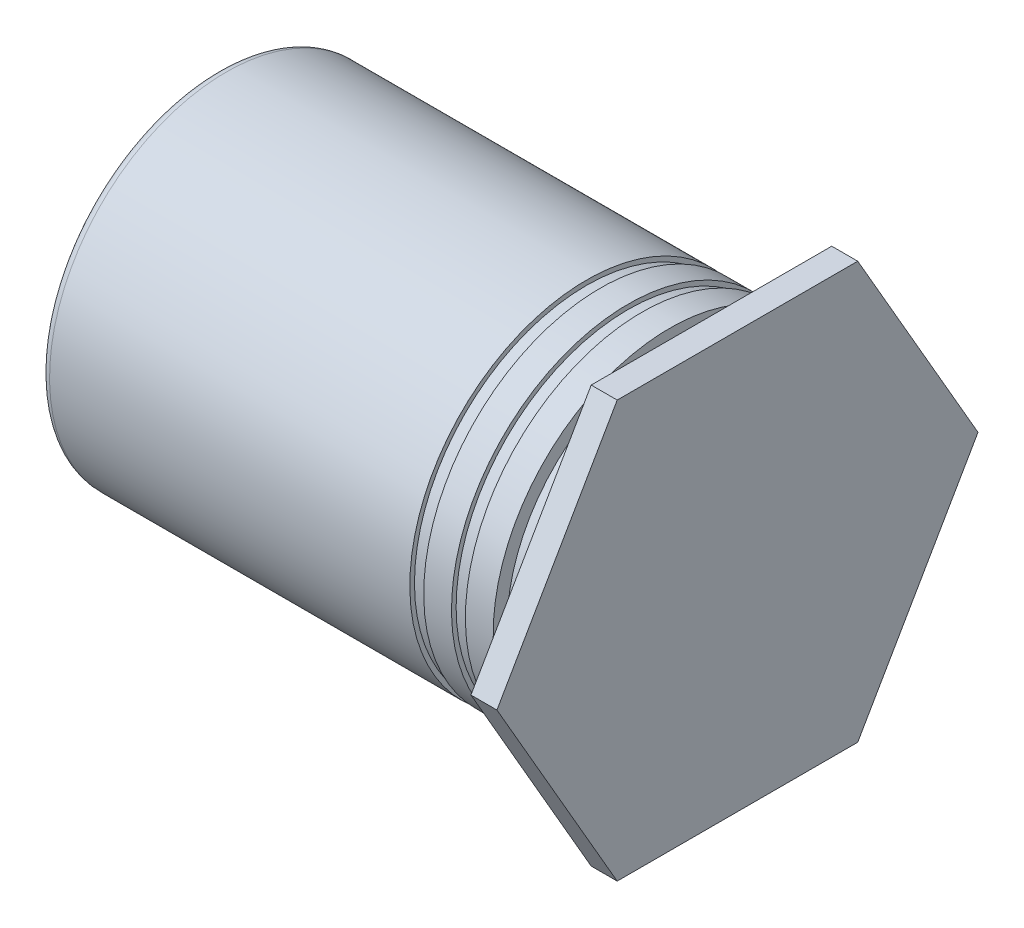
ISO-10303-21;
HEADER;
FILE_DESCRIPTION(('STEP AP214'),'2;1');
FILE_NAME('part.step','',(''),(''),'','','');
FILE_SCHEMA(('AUTOMOTIVE_DESIGN { 1 0 10303 214 1 1 1 1 }'));
ENDSEC;
DATA;
#1=APPLICATION_CONTEXT('core data for automotive mechanical design processes');
#2=APPLICATION_PROTOCOL_DEFINITION('international standard','automotive_design',2000,#1);
#3=PRODUCT_CONTEXT('',#1,'mechanical');
#4=PRODUCT('Part','Part','',(#3));
#5=PRODUCT_RELATED_PRODUCT_CATEGORY('part','',(#4));
#6=PRODUCT_DEFINITION_FORMATION('','',#4);
#7=PRODUCT_DEFINITION_CONTEXT('part definition',#1,'design');
#8=PRODUCT_DEFINITION('design','',#6,#7);
#9=PRODUCT_DEFINITION_SHAPE('','',#8);
#10=(LENGTH_UNIT() NAMED_UNIT(*) SI_UNIT(.MILLI.,.METRE.));
#11=(NAMED_UNIT(*) PLANE_ANGLE_UNIT() SI_UNIT($,.RADIAN.));
#12=(NAMED_UNIT(*) SI_UNIT($,.STERADIAN.) SOLID_ANGLE_UNIT());
#13=UNCERTAINTY_MEASURE_WITH_UNIT(LENGTH_MEASURE(1.E-05),#10,'distance_accuracy_value','');
#14=(GEOMETRIC_REPRESENTATION_CONTEXT(3) GLOBAL_UNCERTAINTY_ASSIGNED_CONTEXT((#13)) GLOBAL_UNIT_ASSIGNED_CONTEXT((#10,
#11,#12)) REPRESENTATION_CONTEXT('',''));
#15=CARTESIAN_POINT('',(0.,0.,0.));
#16=DIRECTION('',(0.,0.,1.));
#17=DIRECTION('',(1.,0.,0.));
#18=AXIS2_PLACEMENT_3D('',#15,#16,#17);
#19=CARTESIAN_POINT('',(0.396240000000001,-1.905,0.));
#20=DIRECTION('',(1.,0.,0.));
#21=DIRECTION('',(0.,1.,0.));
#22=AXIS2_PLACEMENT_3D('',#19,#20,#21);
#23=PLANE('',#22);
#24=DIRECTION('',(0.,0.,-1.));
#25=VECTOR('',#24,1.);
#26=CARTESIAN_POINT('',(0.39624,-3.175,0.));
#27=LINE('',#26,#25);
#28=CARTESIAN_POINT('',(0.39624,-3.175,-1.83308710467706));
#29=VERTEX_POINT('',#28);
#30=CARTESIAN_POINT('',(0.39624,-3.175,1.83308710467706));
#31=VERTEX_POINT('',#30);
#32=EDGE_CURVE('E200',#29,#31,#27,.F.);
#33=ORIENTED_EDGE('',*,*,#32,.F.);
#34=DIRECTION('',(0.,0.866025403784439,-0.5));
#35=VECTOR('',#34,1.);
#36=CARTESIAN_POINT('',(0.39624,-1.5875,-2.74963065701559));
#37=LINE('',#36,#35);
#38=CARTESIAN_POINT('',(0.39624,0.,-3.66617420935412));
#39=VERTEX_POINT('',#38);
#40=EDGE_CURVE('E73',#39,#29,#37,.F.);
#41=ORIENTED_EDGE('',*,*,#40,.F.);
#42=DIRECTION('',(0.,0.866025403784438,0.500000000000001));
#43=VECTOR('',#42,1.);
#44=CARTESIAN_POINT('',(0.39624,1.5875,-2.74963065701559));
#45=LINE('',#44,#43);
#46=CARTESIAN_POINT('',(0.396240000000001,3.175,-1.83308710467706));
#47=VERTEX_POINT('',#46);
#48=EDGE_CURVE('E69',#47,#39,#45,.F.);
#49=ORIENTED_EDGE('',*,*,#48,.F.);
#50=DIRECTION('',(0.,0.,1.));
#51=VECTOR('',#50,1.);
#52=CARTESIAN_POINT('',(0.39624,3.175,0.));
#53=LINE('',#52,#51);
#54=CARTESIAN_POINT('',(0.39624,3.175,1.83308710467706));
#55=VERTEX_POINT('',#54);
#56=EDGE_CURVE('E90',#55,#47,#53,.F.);
#57=ORIENTED_EDGE('',*,*,#56,.F.);
#58=DIRECTION('',(0.,-0.866025403784439,0.5));
#59=VECTOR('',#58,1.);
#60=CARTESIAN_POINT('',(0.39624,1.5875,2.74963065701559));
#61=LINE('',#60,#59);
#62=CARTESIAN_POINT('',(0.39624,0.,3.66617420935412));
#63=VERTEX_POINT('',#62);
#64=EDGE_CURVE('E211',#63,#55,#61,.F.);
#65=ORIENTED_EDGE('',*,*,#64,.F.);
#66=DIRECTION('',(0.,-0.866025403784438,-0.5));
#67=VECTOR('',#66,1.);
#68=CARTESIAN_POINT('',(0.39624,-1.5875,2.74963065701559));
#69=LINE('',#68,#67);
#70=EDGE_CURVE('E204',#31,#63,#69,.F.);
#71=ORIENTED_EDGE('',*,*,#70,.F.);
#72=EDGE_LOOP('',(#33,#41,#49,#57,#65,#71));
#73=FACE_BOUND('',#72,.T.);
#74=ADVANCED_FACE('F17',(#73),#23,.T.);
#75=CARTESIAN_POINT('',(0.19812,1.5875,-2.74963065701559));
#76=DIRECTION('',(0.,0.500000000000001,-0.866025403784438));
#77=DIRECTION('',(0.,0.866025403784438,0.500000000000001));
#78=AXIS2_PLACEMENT_3D('',#75,#76,#77);
#79=PLANE('',#78);
#80=DIRECTION('',(1.,0.,0.));
#81=VECTOR('',#80,1.);
#82=CARTESIAN_POINT('',(0.19812,0.,-3.66617420935412));
#83=LINE('',#82,#81);
#84=CARTESIAN_POINT('',(0.,0.,-3.66617420935412));
#85=VERTEX_POINT('',#84);
#86=EDGE_CURVE('E60',#85,#39,#83,.T.);
#87=ORIENTED_EDGE('',*,*,#86,.F.);
#88=DIRECTION('',(0.,-0.866025403784438,-0.500000000000001));
#89=VECTOR('',#88,1.);
#90=CARTESIAN_POINT('',(0.,3.175,-1.83308710467706));
#91=LINE('',#90,#89);
#92=CARTESIAN_POINT('',(0.,3.175,-1.83308710467706));
#93=VERTEX_POINT('',#92);
#94=EDGE_CURVE('E65',#93,#85,#91,.T.);
#95=ORIENTED_EDGE('',*,*,#94,.F.);
#96=DIRECTION('',(1.,0.,0.));
#97=VECTOR('',#96,1.);
#98=CARTESIAN_POINT('',(0.19812,3.175,-1.83308710467706));
#99=LINE('',#98,#97);
#100=EDGE_CURVE('E187',#47,#93,#99,.F.);
#101=ORIENTED_EDGE('',*,*,#100,.F.);
#102=ORIENTED_EDGE('',*,*,#48,.T.);
#103=EDGE_LOOP('',(#87,#95,#101,#102));
#104=FACE_BOUND('',#103,.T.);
#105=ADVANCED_FACE('F62',(#104),#79,.T.);
#106=CARTESIAN_POINT('',(0.19812,-1.5875,-2.74963065701559));
#107=DIRECTION('',(0.,-0.5,-0.866025403784439));
#108=DIRECTION('',(0.,0.866025403784439,-0.5));
#109=AXIS2_PLACEMENT_3D('',#106,#107,#108);
#110=PLANE('',#109);
#111=DIRECTION('',(1.,0.,0.));
#112=VECTOR('',#111,1.);
#113=CARTESIAN_POINT('',(0.19812,-3.175,-1.83308710467706));
#114=LINE('',#113,#112);
#115=CARTESIAN_POINT('',(0.,-3.175,-1.83308710467706));
#116=VERTEX_POINT('',#115);
#117=EDGE_CURVE('E79',#116,#29,#114,.T.);
#118=ORIENTED_EDGE('',*,*,#117,.F.);
#119=DIRECTION('',(0.,-0.866025403784439,0.5));
#120=VECTOR('',#119,1.);
#121=CARTESIAN_POINT('',(0.,0.,-3.66617420935412));
#122=LINE('',#121,#120);
#123=EDGE_CURVE('E76',#85,#116,#122,.T.);
#124=ORIENTED_EDGE('',*,*,#123,.F.);
#125=ORIENTED_EDGE('',*,*,#86,.T.);
#126=ORIENTED_EDGE('',*,*,#40,.T.);
#127=EDGE_LOOP('',(#118,#124,#125,#126));
#128=FACE_BOUND('',#127,.T.);
#129=ADVANCED_FACE('F77',(#128),#110,.T.);
#130=CARTESIAN_POINT('',(0.19812,-3.175,0.));
#131=DIRECTION('',(0.,-1.,0.));
#132=DIRECTION('',(0.,0.,-1.));
#133=AXIS2_PLACEMENT_3D('',#130,#131,#132);
#134=PLANE('',#133);
#135=DIRECTION('',(1.,0.,0.));
#136=VECTOR('',#135,1.);
#137=CARTESIAN_POINT('',(0.19812,-3.175,1.83308710467706));
#138=LINE('',#137,#136);
#139=CARTESIAN_POINT('',(0.,-3.175,1.83308710467706));
#140=VERTEX_POINT('',#139);
#141=EDGE_CURVE('E197',#140,#31,#138,.T.);
#142=ORIENTED_EDGE('',*,*,#141,.F.);
#143=DIRECTION('',(0.,0.,1.));
#144=VECTOR('',#143,1.);
#145=CARTESIAN_POINT('',(0.,-3.175,0.));
#146=LINE('',#145,#144);
#147=EDGE_CURVE('E83',#116,#140,#146,.T.);
#148=ORIENTED_EDGE('',*,*,#147,.F.);
#149=ORIENTED_EDGE('',*,*,#117,.T.);
#150=ORIENTED_EDGE('',*,*,#32,.T.);
#151=EDGE_LOOP('',(#142,#148,#149,#150));
#152=FACE_BOUND('',#151,.T.);
#153=ADVANCED_FACE('F193',(#152),#134,.T.);
#154=CARTESIAN_POINT('',(0.19812,-1.5875,2.74963065701559));
#155=DIRECTION('',(0.,-0.5,0.866025403784438));
#156=DIRECTION('',(0.,-0.866025403784438,-0.5));
#157=AXIS2_PLACEMENT_3D('',#154,#155,#156);
#158=PLANE('',#157);
#159=DIRECTION('',(1.,0.,0.));
#160=VECTOR('',#159,1.);
#161=CARTESIAN_POINT('',(0.19812,0.,3.66617420935412));
#162=LINE('',#161,#160);
#163=CARTESIAN_POINT('',(0.,0.,3.66617420935412));
#164=VERTEX_POINT('',#163);
#165=EDGE_CURVE('E208',#164,#63,#162,.T.);
#166=ORIENTED_EDGE('',*,*,#165,.F.);
#167=DIRECTION('',(0.,0.866025403784438,0.5));
#168=VECTOR('',#167,1.);
#169=CARTESIAN_POINT('',(0.,-3.175,1.83308710467706));
#170=LINE('',#169,#168);
#171=EDGE_CURVE('E184',#140,#164,#170,.T.);
#172=ORIENTED_EDGE('',*,*,#171,.F.);
#173=ORIENTED_EDGE('',*,*,#141,.T.);
#174=ORIENTED_EDGE('',*,*,#70,.T.);
#175=EDGE_LOOP('',(#166,#172,#173,#174));
#176=FACE_BOUND('',#175,.T.);
#177=ADVANCED_FACE('F206',(#176),#158,.T.);
#178=CARTESIAN_POINT('',(0.19812,1.5875,2.74963065701559));
#179=DIRECTION('',(0.,0.5,0.866025403784439));
#180=DIRECTION('',(0.,-0.866025403784439,0.5));
#181=AXIS2_PLACEMENT_3D('',#178,#179,#180);
#182=PLANE('',#181);
#183=DIRECTION('',(1.,0.,0.));
#184=VECTOR('',#183,1.);
#185=CARTESIAN_POINT('',(0.19812,3.175,1.83308710467706));
#186=LINE('',#185,#184);
#187=CARTESIAN_POINT('',(0.,3.175,1.83308710467706));
#188=VERTEX_POINT('',#187);
#189=EDGE_CURVE('E38',#188,#55,#186,.T.);
#190=ORIENTED_EDGE('',*,*,#189,.F.);
#191=DIRECTION('',(0.,0.866025403784439,-0.5));
#192=VECTOR('',#191,1.);
#193=CARTESIAN_POINT('',(0.,0.,3.66617420935412));
#194=LINE('',#193,#192);
#195=EDGE_CURVE('E182',#164,#188,#194,.T.);
#196=ORIENTED_EDGE('',*,*,#195,.F.);
#197=ORIENTED_EDGE('',*,*,#165,.T.);
#198=ORIENTED_EDGE('',*,*,#64,.T.);
#199=EDGE_LOOP('',(#190,#196,#197,#198));
#200=FACE_BOUND('',#199,.T.);
#201=ADVANCED_FACE('F213',(#200),#182,.T.);
#202=CARTESIAN_POINT('',(0.19812,3.175,0.));
#203=DIRECTION('',(0.,1.,0.));
#204=DIRECTION('',(0.,0.,1.));
#205=AXIS2_PLACEMENT_3D('',#202,#203,#204);
#206=PLANE('',#205);
#207=ORIENTED_EDGE('',*,*,#189,.T.);
#208=ORIENTED_EDGE('',*,*,#56,.T.);
#209=ORIENTED_EDGE('',*,*,#100,.T.);
#210=DIRECTION('',(0.,0.,1.));
#211=VECTOR('',#210,1.);
#212=CARTESIAN_POINT('',(0.,3.175,0.));
#213=LINE('',#212,#211);
#214=EDGE_CURVE('E89',#188,#93,#213,.F.);
#215=ORIENTED_EDGE('',*,*,#214,.F.);
#216=EDGE_LOOP('',(#207,#208,#209,#215));
#217=FACE_BOUND('',#216,.T.);
#218=ADVANCED_FACE('F215',(#217),#206,.T.);
#219=CARTESIAN_POINT('',(0.,-3.2512,0.));
#220=DIRECTION('',(-1.,0.,0.));
#221=DIRECTION('',(0.,-1.,0.));
#222=AXIS2_PLACEMENT_3D('',#219,#220,#221);
#223=PLANE('',#222);
#224=ORIENTED_EDGE('',*,*,#195,.T.);
#225=ORIENTED_EDGE('',*,*,#214,.T.);
#226=ORIENTED_EDGE('',*,*,#94,.T.);
#227=ORIENTED_EDGE('',*,*,#123,.T.);
#228=ORIENTED_EDGE('',*,*,#147,.T.);
#229=ORIENTED_EDGE('',*,*,#171,.T.);
#230=EDGE_LOOP('',(#224,#225,#226,#227,#228,#229));
#231=FACE_BOUND('',#230,.T.);
#232=CARTESIAN_POINT('',(0.,0.,0.));
#233=DIRECTION('',(-1.,0.,0.));
#234=DIRECTION('',(0.,0.,1.));
#235=AXIS2_PLACEMENT_3D('',#232,#233,#234);
#236=CIRCLE('',#235,2.48073333333333);
#237=CARTESIAN_POINT('',(0.,0.,2.48073333333333));
#238=VERTEX_POINT('',#237);
#239=EDGE_CURVE('E21',#238,#238,#236,.F.);
#240=ORIENTED_EDGE('',*,*,#239,.T.);
#241=EDGE_LOOP('',(#240));
#242=FACE_BOUND('',#241,.T.);
#243=ADVANCED_FACE('F87',(#231,#242),#223,.T.);
#244=CARTESIAN_POINT('',(0.,0.,0.));
#245=DIRECTION('',(-1.,0.,0.));
#246=DIRECTION('',(0.,0.,1.));
#247=AXIS2_PLACEMENT_3D('',#244,#245,#246);
#248=CYLINDRICAL_SURFACE('',#247,2.48073333333333);
#249=ORIENTED_EDGE('',*,*,#239,.F.);
#250=EDGE_LOOP('',(#249));
#251=FACE_BOUND('',#250,.T.);
#252=CARTESIAN_POINT('',(-0.635,0.,0.));
#253=DIRECTION('',(-1.,0.,0.));
#254=DIRECTION('',(0.,0.,1.));
#255=AXIS2_PLACEMENT_3D('',#252,#253,#254);
#256=CIRCLE('',#255,2.48073333333333);
#257=CARTESIAN_POINT('',(-0.635,0.,2.48073333333333));
#258=VERTEX_POINT('',#257);
#259=EDGE_CURVE('E176',#258,#258,#256,.F.);
#260=ORIENTED_EDGE('',*,*,#259,.T.);
#261=EDGE_LOOP('',(#260));
#262=FACE_BOUND('',#261,.T.);
#263=ADVANCED_FACE('F338',(#251,#262),#248,.T.);
#264=CARTESIAN_POINT('',(-0.635,0.,-2.58656666666667));
#265=DIRECTION('',(-1.,0.,0.));
#266=DIRECTION('',(0.,0.,1.));
#267=AXIS2_PLACEMENT_3D('',#264,#265,#266);
#268=PLANE('',#267);
#269=CARTESIAN_POINT('',(-0.635,0.,0.));
#270=DIRECTION('',(-1.,0.,0.));
#271=DIRECTION('',(0.,-1.,0.));
#272=AXIS2_PLACEMENT_3D('',#269,#270,#271);
#273=CIRCLE('',#272,2.6924);
#274=CARTESIAN_POINT('',(-0.635,-2.6924,0.));
#275=VERTEX_POINT('',#274);
#276=EDGE_CURVE('E174',#275,#275,#273,.T.);
#277=ORIENTED_EDGE('',*,*,#276,.F.);
#278=EDGE_LOOP('',(#277));
#279=FACE_BOUND('',#278,.T.);
#280=ORIENTED_EDGE('',*,*,#259,.F.);
#281=EDGE_LOOP('',(#280));
#282=FACE_BOUND('',#281,.T.);
#283=ADVANCED_FACE('F330',(#279,#282),#268,.F.);
#284=CARTESIAN_POINT('',(-3.69824,0.,0.));
#285=DIRECTION('',(-1.,0.,0.));
#286=DIRECTION('',(0.,-1.,0.));
#287=AXIS2_PLACEMENT_3D('',#284,#285,#286);
#288=CYLINDRICAL_SURFACE('',#287,2.6924);
#289=CARTESIAN_POINT('',(-1.05833333333333,0.,0.));
#290=DIRECTION('',(-1.,0.,0.));
#291=DIRECTION('',(0.,-1.,0.));
#292=AXIS2_PLACEMENT_3D('',#289,#290,#291);
#293=CIRCLE('',#292,2.6924);
#294=CARTESIAN_POINT('',(-1.05833333333333,-2.6924,0.));
#295=VERTEX_POINT('',#294);
#296=EDGE_CURVE('E146',#295,#295,#293,.F.);
#297=ORIENTED_EDGE('',*,*,#296,.T.);
#298=EDGE_LOOP('',(#297));
#299=FACE_BOUND('',#298,.T.);
#300=ORIENTED_EDGE('',*,*,#276,.T.);
#301=EDGE_LOOP('',(#300));
#302=FACE_BOUND('',#301,.T.);
#303=ADVANCED_FACE('F323',(#299,#302),#288,.T.);
#304=CARTESIAN_POINT('',(-1.18871999990233,0.,0.));
#305=DIRECTION('',(-1.,0.,0.));
#306=DIRECTION('',(0.,-1.,0.));
#307=AXIS2_PLACEMENT_3D('',#304,#305,#306);
#308=CONICAL_SURFACE('',#307,1.48589999980686,1.04719755093188);
#309=CARTESIAN_POINT('',(-0.330835234819915,0.,8.52655278452E-11));
#310=VERTEX_POINT('',#309);
#311=VERTEX_LOOP('',#310);
#312=FACE_BOUND('',#311,.T.);
#313=CARTESIAN_POINT('',(-1.18872,0.,0.));
#314=DIRECTION('',(-1.,0.,0.));
#315=DIRECTION('',(0.,-1.,0.));
#316=AXIS2_PLACEMENT_3D('',#313,#314,#315);
#317=CIRCLE('',#316,1.4859);
#318=CARTESIAN_POINT('',(-1.18872,-1.4859,0.));
#319=VERTEX_POINT('',#318);
#320=EDGE_CURVE('E143',#319,#319,#317,.T.);
#321=ORIENTED_EDGE('',*,*,#320,.T.);
#322=EDGE_LOOP('',(#321));
#323=FACE_BOUND('',#322,.T.);
#324=ADVANCED_FACE('F315',(#312,#323),#308,.F.);
#325=CARTESIAN_POINT('',(-1.05833333333333,0.,-2.65712222222222));
#326=DIRECTION('',(1.,0.,0.));
#327=DIRECTION('',(0.,1.,0.));
#328=AXIS2_PLACEMENT_3D('',#325,#326,#327);
#329=PLANE('',#328);
#330=CARTESIAN_POINT('',(-1.05833333333333,0.,0.));
#331=DIRECTION('',(-1.,0.,0.));
#332=DIRECTION('',(0.,0.,1.));
#333=AXIS2_PLACEMENT_3D('',#330,#331,#332);
#334=CIRCLE('',#333,2.62184444444444);
#335=CARTESIAN_POINT('',(-1.05833333333333,0.,2.62184444444444));
#336=VERTEX_POINT('',#335);
#337=EDGE_CURVE('E145',#336,#336,#334,.F.);
#338=ORIENTED_EDGE('',*,*,#337,.T.);
#339=EDGE_LOOP('',(#338));
#340=FACE_BOUND('',#339,.T.);
#341=ORIENTED_EDGE('',*,*,#296,.F.);
#342=EDGE_LOOP('',(#341));
#343=FACE_BOUND('',#342,.T.);
#344=ADVANCED_FACE('F307',(#340,#343),#329,.F.);
#345=CARTESIAN_POINT('',(-2.37744,0.,0.));
#346=DIRECTION('',(-1.,0.,0.));
#347=DIRECTION('',(0.,-1.,0.));
#348=AXIS2_PLACEMENT_3D('',#345,#346,#347);
#349=CYLINDRICAL_SURFACE('',#348,1.4859);
#350=CARTESIAN_POINT('',(-3.56616,0.,0.));
#351=DIRECTION('',(-1.,0.,0.));
#352=DIRECTION('',(0.,-1.,0.));
#353=AXIS2_PLACEMENT_3D('',#350,#351,#352);
#354=CIRCLE('',#353,1.4859);
#355=CARTESIAN_POINT('',(-3.56616,-1.4859,0.));
#356=VERTEX_POINT('',#355);
#357=EDGE_CURVE('E167',#356,#356,#354,.F.);
#358=ORIENTED_EDGE('',*,*,#357,.F.);
#359=EDGE_LOOP('',(#358));
#360=FACE_BOUND('',#359,.T.);
#361=ORIENTED_EDGE('',*,*,#320,.F.);
#362=EDGE_LOOP('',(#361));
#363=FACE_BOUND('',#362,.T.);
#364=ADVANCED_FACE('F299',(#360,#363),#349,.F.);
#365=CARTESIAN_POINT('',(-1.05833333333333,0.,0.));
#366=DIRECTION('',(-1.,0.,0.));
#367=DIRECTION('',(0.,0.,1.));
#368=AXIS2_PLACEMENT_3D('',#365,#366,#367);
#369=CYLINDRICAL_SURFACE('',#368,2.62184444444444);
#370=ORIENTED_EDGE('',*,*,#337,.F.);
#371=EDGE_LOOP('',(#370));
#372=FACE_BOUND('',#371,.T.);
#373=CARTESIAN_POINT('',(-1.27,0.,0.));
#374=DIRECTION('',(-1.,0.,0.));
#375=DIRECTION('',(0.,0.,1.));
#376=AXIS2_PLACEMENT_3D('',#373,#374,#375);
#377=CIRCLE('',#376,2.62184444444444);
#378=CARTESIAN_POINT('',(-1.27,0.,2.62184444444444));
#379=VERTEX_POINT('',#378);
#380=EDGE_CURVE('E164',#379,#379,#377,.F.);
#381=ORIENTED_EDGE('',*,*,#380,.T.);
#382=EDGE_LOOP('',(#381));
#383=FACE_BOUND('',#382,.T.);
#384=ADVANCED_FACE('F291',(#372,#383),#369,.T.);
#385=CARTESIAN_POINT('',(-3.56616,0.,-1.55575));
#386=DIRECTION('',(1.,0.,0.));
#387=DIRECTION('',(0.,0.,-1.));
#388=AXIS2_PLACEMENT_3D('',#385,#386,#387);
#389=PLANE('',#388);
#390=CARTESIAN_POINT('',(-3.56616,0.,0.));
#391=DIRECTION('',(-1.,0.,0.));
#392=DIRECTION('',(0.,-1.,0.));
#393=AXIS2_PLACEMENT_3D('',#390,#391,#392);
#394=CIRCLE('',#393,1.3589);
#395=CARTESIAN_POINT('',(-3.56616,-1.3589,0.));
#396=VERTEX_POINT('',#395);
#397=EDGE_CURVE('E161',#396,#396,#394,.F.);
#398=ORIENTED_EDGE('',*,*,#397,.F.);
#399=EDGE_LOOP('',(#398));
#400=FACE_BOUND('',#399,.T.);
#401=ORIENTED_EDGE('',*,*,#357,.T.);
#402=EDGE_LOOP('',(#401));
#403=FACE_BOUND('',#402,.T.);
#404=ADVANCED_FACE('F283',(#400,#403),#389,.T.);
#405=CARTESIAN_POINT('',(-1.27,0.,-2.65712222222222));
#406=DIRECTION('',(-1.,0.,0.));
#407=DIRECTION('',(0.,0.,1.));
#408=AXIS2_PLACEMENT_3D('',#405,#406,#407);
#409=PLANE('',#408);
#410=CARTESIAN_POINT('',(-1.27,0.,0.));
#411=DIRECTION('',(-1.,0.,0.));
#412=DIRECTION('',(0.,-1.,0.));
#413=AXIS2_PLACEMENT_3D('',#410,#411,#412);
#414=CIRCLE('',#413,2.6924);
#415=CARTESIAN_POINT('',(-1.27,-2.6924,0.));
#416=VERTEX_POINT('',#415);
#417=EDGE_CURVE('E142',#416,#416,#414,.T.);
#418=ORIENTED_EDGE('',*,*,#417,.F.);
#419=EDGE_LOOP('',(#418));
#420=FACE_BOUND('',#419,.T.);
#421=ORIENTED_EDGE('',*,*,#380,.F.);
#422=EDGE_LOOP('',(#421));
#423=FACE_BOUND('',#422,.T.);
#424=ADVANCED_FACE('F275',(#420,#423),#409,.F.);
#425=CARTESIAN_POINT('',(-3.56616,0.,0.));
#426=DIRECTION('',(-1.,0.,0.));
#427=DIRECTION('',(0.,-1.,0.));
#428=AXIS2_PLACEMENT_3D('',#425,#426,#427);
#429=CYLINDRICAL_SURFACE('',#428,1.3589);
#430=ORIENTED_EDGE('',*,*,#397,.T.);
#431=EDGE_LOOP('',(#430));
#432=FACE_BOUND('',#431,.T.);
#433=CARTESIAN_POINT('',(-7.13486000000785,0.,0.));
#434=DIRECTION('',(-1.,0.,0.));
#435=DIRECTION('',(0.,0.,-1.));
#436=AXIS2_PLACEMENT_3D('',#433,#434,#435);
#437=CIRCLE('',#436,1.35890000001382);
#438=CARTESIAN_POINT('',(-7.13486000000785,0.,-1.35890000001382));
#439=VERTEX_POINT('',#438);
#440=EDGE_CURVE('E133',#439,#439,#437,.F.);
#441=ORIENTED_EDGE('',*,*,#440,.F.);
#442=EDGE_LOOP('',(#441));
#443=FACE_BOUND('',#442,.T.);
#444=ADVANCED_FACE('F267',(#432,#443),#429,.F.);
#445=CARTESIAN_POINT('',(-3.69824,0.,0.));
#446=DIRECTION('',(-1.,0.,0.));
#447=DIRECTION('',(0.,-1.,0.));
#448=AXIS2_PLACEMENT_3D('',#445,#446,#447);
#449=CYLINDRICAL_SURFACE('',#448,2.6924);
#450=CARTESIAN_POINT('',(-1.69333333333333,0.,0.));
#451=DIRECTION('',(-1.,0.,0.));
#452=DIRECTION('',(0.,-1.,0.));
#453=AXIS2_PLACEMENT_3D('',#450,#451,#452);
#454=CIRCLE('',#453,2.6924);
#455=CARTESIAN_POINT('',(-1.69333333333333,-2.6924,0.));
#456=VERTEX_POINT('',#455);
#457=EDGE_CURVE('E141',#456,#456,#454,.F.);
#458=ORIENTED_EDGE('',*,*,#457,.T.);
#459=EDGE_LOOP('',(#458));
#460=FACE_BOUND('',#459,.T.);
#461=ORIENTED_EDGE('',*,*,#417,.T.);
#462=EDGE_LOOP('',(#461));
#463=FACE_BOUND('',#462,.T.);
#464=ADVANCED_FACE('F260',(#460,#463),#449,.T.);
#465=CARTESIAN_POINT('',(-7.13486000000785,0.,0.));
#466=DIRECTION('',(-1.,0.,0.));
#467=DIRECTION('',(0.,0.,1.));
#468=AXIS2_PLACEMENT_3D('',#465,#466,#467);
#469=CONICAL_SURFACE('',#468,1.35890000001382,0.785398163397448);
#470=ORIENTED_EDGE('',*,*,#440,.T.);
#471=EDGE_LOOP('',(#470));
#472=FACE_BOUND('',#471,.T.);
#473=CARTESIAN_POINT('',(-7.52855999996882,0.,0.));
#474=DIRECTION('',(-1.,0.,0.));
#475=DIRECTION('',(0.,0.,1.));
#476=AXIS2_PLACEMENT_3D('',#473,#474,#475);
#477=CIRCLE('',#476,1.75259999997479);
#478=CARTESIAN_POINT('',(-7.52855999996882,0.,1.75259999997479));
#479=VERTEX_POINT('',#478);
#480=EDGE_CURVE('E154',#479,#479,#477,.F.);
#481=ORIENTED_EDGE('',*,*,#480,.F.);
#482=EDGE_LOOP('',(#481));
#483=FACE_BOUND('',#482,.T.);
#484=ADVANCED_FACE('F253',(#472,#483),#469,.F.);
#485=CARTESIAN_POINT('',(-1.69333333333333,0.,-2.65712222222222));
#486=DIRECTION('',(1.,0.,0.));
#487=DIRECTION('',(0.,1.,0.));
#488=AXIS2_PLACEMENT_3D('',#485,#486,#487);
#489=PLANE('',#488);
#490=CARTESIAN_POINT('',(-1.69333333333333,0.,0.));
#491=DIRECTION('',(-1.,0.,0.));
#492=DIRECTION('',(0.,0.,1.));
#493=AXIS2_PLACEMENT_3D('',#490,#491,#492);
#494=CIRCLE('',#493,2.62184444444444);
#495=CARTESIAN_POINT('',(-1.69333333333333,0.,2.62184444444444));
#496=VERTEX_POINT('',#495);
#497=EDGE_CURVE('E151',#496,#496,#494,.F.);
#498=ORIENTED_EDGE('',*,*,#497,.T.);
#499=EDGE_LOOP('',(#498));
#500=FACE_BOUND('',#499,.T.);
#501=ORIENTED_EDGE('',*,*,#457,.F.);
#502=EDGE_LOOP('',(#501));
#503=FACE_BOUND('',#502,.T.);
#504=ADVANCED_FACE('F118',(#500,#503),#489,.F.);
#505=CARTESIAN_POINT('',(-7.52856,-1.28016,0.));
#506=DIRECTION('',(-1.,0.,0.));
#507=DIRECTION('',(0.,-1.,0.));
#508=AXIS2_PLACEMENT_3D('',#505,#506,#507);
#509=PLANE('',#508);
#510=CARTESIAN_POINT('',(-7.52856,0.,0.));
#511=DIRECTION('',(1.,0.,0.));
#512=DIRECTION('',(0.,-1.,0.));
#513=AXIS2_PLACEMENT_3D('',#510,#511,#512);
#514=CIRCLE('',#513,2.56032);
#515=CARTESIAN_POINT('',(-7.52856,-2.56032,0.));
#516=VERTEX_POINT('',#515);
#517=EDGE_CURVE('E100',#516,#516,#514,.T.);
#518=ORIENTED_EDGE('',*,*,#517,.F.);
#519=EDGE_LOOP('',(#518));
#520=FACE_BOUND('',#519,.T.);
#521=ORIENTED_EDGE('',*,*,#480,.T.);
#522=EDGE_LOOP('',(#521));
#523=FACE_BOUND('',#522,.T.);
#524=ADVANCED_FACE('F107',(#520,#523),#509,.T.);
#525=CARTESIAN_POINT('',(-1.69333333333333,0.,0.));
#526=DIRECTION('',(-1.,0.,0.));
#527=DIRECTION('',(0.,0.,1.));
#528=AXIS2_PLACEMENT_3D('',#525,#526,#527);
#529=CYLINDRICAL_SURFACE('',#528,2.62184444444444);
#530=ORIENTED_EDGE('',*,*,#497,.F.);
#531=EDGE_LOOP('',(#530));
#532=FACE_BOUND('',#531,.T.);
#533=CARTESIAN_POINT('',(-1.905,0.,0.));
#534=DIRECTION('',(-1.,0.,0.));
#535=DIRECTION('',(0.,0.,1.));
#536=AXIS2_PLACEMENT_3D('',#533,#534,#535);
#537=CIRCLE('',#536,2.62184444444444);
#538=CARTESIAN_POINT('',(-1.905,0.,2.62184444444444));
#539=VERTEX_POINT('',#538);
#540=EDGE_CURVE('E148',#539,#539,#537,.F.);
#541=ORIENTED_EDGE('',*,*,#540,.T.);
#542=EDGE_LOOP('',(#541));
#543=FACE_BOUND('',#542,.T.);
#544=ADVANCED_FACE('F117',(#532,#543),#529,.T.);
#545=CARTESIAN_POINT('',(-7.39648,0.,0.));
#546=DIRECTION('',(-1.,0.,0.));
#547=DIRECTION('',(0.,-1.,0.));
#548=AXIS2_PLACEMENT_3D('',#545,#546,#547);
#549=TOROIDAL_SURFACE('',#548,2.56032,0.132079999999999);
#550=CARTESIAN_POINT('',(-7.39648,0.,0.));
#551=DIRECTION('',(-1.,0.,0.));
#552=DIRECTION('',(0.,-1.,0.));
#553=AXIS2_PLACEMENT_3D('',#550,#551,#552);
#554=CIRCLE('',#553,2.6924);
#555=CARTESIAN_POINT('',(-7.39648,-2.6924,0.));
#556=VERTEX_POINT('',#555);
#557=EDGE_CURVE('E26',#556,#556,#554,.F.);
#558=ORIENTED_EDGE('',*,*,#557,.F.);
#559=EDGE_LOOP('',(#558));
#560=FACE_BOUND('',#559,.T.);
#561=ORIENTED_EDGE('',*,*,#517,.T.);
#562=EDGE_LOOP('',(#561));
#563=FACE_BOUND('',#562,.T.);
#564=ADVANCED_FACE('F122',(#560,#563),#549,.T.);
#565=CARTESIAN_POINT('',(-1.905,0.,-2.65712222222222));
#566=DIRECTION('',(-1.,0.,0.));
#567=DIRECTION('',(0.,0.,1.));
#568=AXIS2_PLACEMENT_3D('',#565,#566,#567);
#569=PLANE('',#568);
#570=CARTESIAN_POINT('',(-1.905,0.,0.));
#571=DIRECTION('',(-1.,0.,0.));
#572=DIRECTION('',(0.,-1.,0.));
#573=AXIS2_PLACEMENT_3D('',#570,#571,#572);
#574=CIRCLE('',#573,2.6924);
#575=CARTESIAN_POINT('',(-1.905,-2.6924,0.));
#576=VERTEX_POINT('',#575);
#577=EDGE_CURVE('E11',#576,#576,#574,.T.);
#578=ORIENTED_EDGE('',*,*,#577,.F.);
#579=EDGE_LOOP('',(#578));
#580=FACE_BOUND('',#579,.T.);
#581=ORIENTED_EDGE('',*,*,#540,.F.);
#582=EDGE_LOOP('',(#581));
#583=FACE_BOUND('',#582,.T.);
#584=ADVANCED_FACE('F126',(#580,#583),#569,.F.);
#585=CARTESIAN_POINT('',(-3.69824,0.,0.));
#586=DIRECTION('',(-1.,0.,0.));
#587=DIRECTION('',(0.,-1.,0.));
#588=AXIS2_PLACEMENT_3D('',#585,#586,#587);
#589=CYLINDRICAL_SURFACE('',#588,2.6924);
#590=ORIENTED_EDGE('',*,*,#557,.T.);
#591=EDGE_LOOP('',(#590));
#592=FACE_BOUND('',#591,.T.);
#593=ORIENTED_EDGE('',*,*,#577,.T.);
#594=EDGE_LOOP('',(#593));
#595=FACE_BOUND('',#594,.T.);
#596=ADVANCED_FACE('F19',(#592,#595),#589,.T.);
#597=CLOSED_SHELL('',(#74,#105,#129,#153,#177,#201,#218,#243,#263,#283,#303,#324,#344,#364,#384,
#404,#424,#444,#464,#484,#504,#524,#544,#564,#584,#596));
#598=MANIFOLD_SOLID_BREP('B1',#597);
#599=ADVANCED_BREP_SHAPE_REPRESENTATION('',(#18,#598),#14);
#600=SHAPE_DEFINITION_REPRESENTATION(#9,#599);
ENDSEC;
END-ISO-10303-21;
